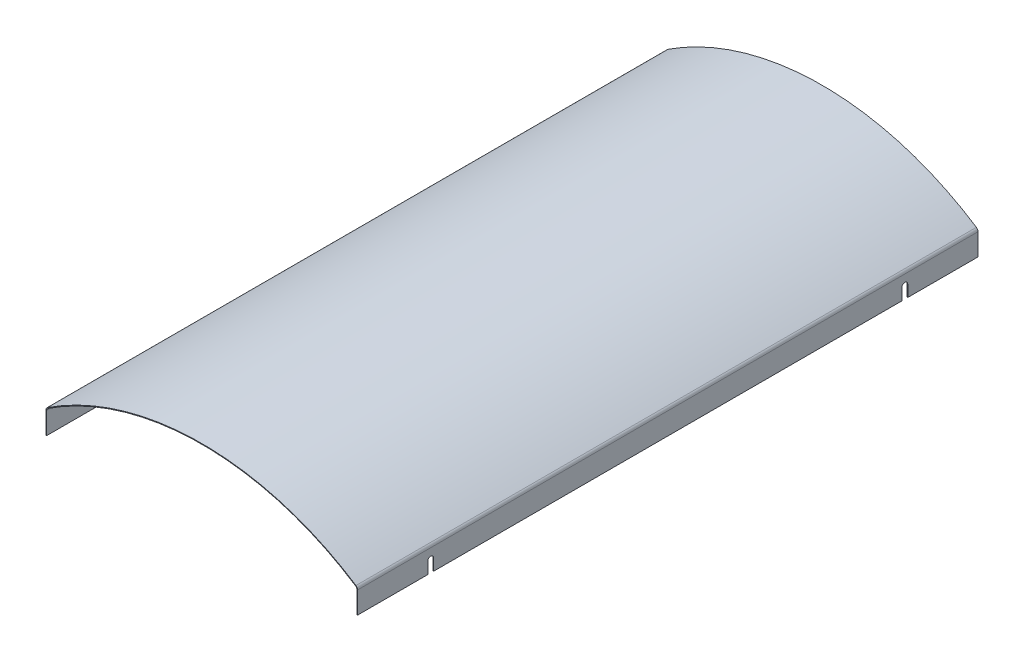
ISO-10303-21;
HEADER;
FILE_DESCRIPTION(('STEP AP214'),'2;1');
FILE_NAME('part.step','',(''),(''),'','','');
FILE_SCHEMA(('AUTOMOTIVE_DESIGN { 1 0 10303 214 1 1 1 1 }'));
ENDSEC;
DATA;
#1=APPLICATION_CONTEXT('core data for automotive mechanical design processes');
#2=APPLICATION_PROTOCOL_DEFINITION('international standard','automotive_design',2000,#1);
#3=PRODUCT_CONTEXT('',#1,'mechanical');
#4=PRODUCT('Part','Part','',(#3));
#5=PRODUCT_RELATED_PRODUCT_CATEGORY('part','',(#4));
#6=PRODUCT_DEFINITION_FORMATION('','',#4);
#7=PRODUCT_DEFINITION_CONTEXT('part definition',#1,'design');
#8=PRODUCT_DEFINITION('design','',#6,#7);
#9=PRODUCT_DEFINITION_SHAPE('','',#8);
#10=(LENGTH_UNIT() NAMED_UNIT(*) SI_UNIT(.MILLI.,.METRE.));
#11=(NAMED_UNIT(*) PLANE_ANGLE_UNIT() SI_UNIT($,.RADIAN.));
#12=(NAMED_UNIT(*) SI_UNIT($,.STERADIAN.) SOLID_ANGLE_UNIT());
#13=UNCERTAINTY_MEASURE_WITH_UNIT(LENGTH_MEASURE(1.E-05),#10,'distance_accuracy_value','');
#14=(GEOMETRIC_REPRESENTATION_CONTEXT(3) GLOBAL_UNCERTAINTY_ASSIGNED_CONTEXT((#13)) GLOBAL_UNIT_ASSIGNED_CONTEXT((#10,
#11,#12)) REPRESENTATION_CONTEXT('',''));
#15=CARTESIAN_POINT('',(0.,0.,0.));
#16=DIRECTION('',(0.,0.,1.));
#17=DIRECTION('',(1.,0.,0.));
#18=AXIS2_PLACEMENT_3D('',#15,#16,#17);
#19=CARTESIAN_POINT('',(-336.55,1067.07773657716,673.1));
#20=DIRECTION('',(0.,-1.,0.));
#21=DIRECTION('',(0.,0.,-1.));
#22=AXIS2_PLACEMENT_3D('',#19,#20,#21);
#23=PLANE('',#22);
#24=DIRECTION('',(-1.,0.,0.));
#25=VECTOR('',#24,1.);
#26=CARTESIAN_POINT('',(338.05,1067.07773657716,520.7));
#27=LINE('',#26,#25);
#28=CARTESIAN_POINT('',(-336.55,1067.07773657716,520.7));
#29=VERTEX_POINT('',#28);
#30=CARTESIAN_POINT('',(-338.050000000001,1067.07773657716,520.7));
#31=VERTEX_POINT('',#30);
#32=EDGE_CURVE('E253',#29,#31,#27,.T.);
#33=ORIENTED_EDGE('',*,*,#32,.F.);
#34=DIRECTION('',(0.,0.,-1.));
#35=VECTOR('',#34,1.);
#36=CARTESIAN_POINT('',(-336.55,1067.07773657716,673.1));
#37=LINE('',#36,#35);
#38=CARTESIAN_POINT('',(-336.55,1067.07773657716,673.1));
#39=VERTEX_POINT('',#38);
#40=EDGE_CURVE('E403',#39,#29,#37,.T.);
#41=ORIENTED_EDGE('',*,*,#40,.F.);
#42=DIRECTION('',(-1.,0.,0.));
#43=VECTOR('',#42,1.);
#44=CARTESIAN_POINT('',(-336.55,1067.07773657716,673.1));
#45=LINE('',#44,#43);
#46=CARTESIAN_POINT('',(-338.05,1067.07773657716,673.1));
#47=VERTEX_POINT('',#46);
#48=EDGE_CURVE('E374',#39,#47,#45,.T.);
#49=ORIENTED_EDGE('',*,*,#48,.T.);
#50=DIRECTION('',(0.,0.,-1.));
#51=VECTOR('',#50,1.);
#52=CARTESIAN_POINT('',(-338.05,1067.07773657716,673.1));
#53=LINE('',#52,#51);
#54=EDGE_CURVE('E408',#47,#31,#53,.T.);
#55=ORIENTED_EDGE('',*,*,#54,.T.);
#56=EDGE_LOOP('',(#33,#41,#49,#55));
#57=FACE_BOUND('',#56,.T.);
#58=ADVANCED_FACE('F32',(#57),#23,.T.);
#59=CARTESIAN_POINT('',(336.55,1067.07773657716,673.1));
#60=DIRECTION('',(0.,1.,0.));
#61=DIRECTION('',(0.,0.,1.));
#62=AXIS2_PLACEMENT_3D('',#59,#60,#61);
#63=PLANE('',#62);
#64=DIRECTION('',(0.,0.,-1.));
#65=VECTOR('',#64,1.);
#66=CARTESIAN_POINT('',(336.55,1067.07773657716,673.1));
#67=LINE('',#66,#65);
#68=CARTESIAN_POINT('',(336.55,1067.07773657716,673.1));
#69=VERTEX_POINT('',#68);
#70=CARTESIAN_POINT('',(336.55,1067.07773657716,520.7));
#71=VERTEX_POINT('',#70);
#72=EDGE_CURVE('E353',#69,#71,#67,.T.);
#73=ORIENTED_EDGE('',*,*,#72,.T.);
#74=CARTESIAN_POINT('',(338.05,1067.07773657716,520.7));
#75=VERTEX_POINT('',#74);
#76=EDGE_CURVE('E251',#75,#71,#27,.T.);
#77=ORIENTED_EDGE('',*,*,#76,.F.);
#78=DIRECTION('',(0.,0.,-1.));
#79=VECTOR('',#78,1.);
#80=CARTESIAN_POINT('',(338.05,1067.07773657716,673.1));
#81=LINE('',#80,#79);
#82=CARTESIAN_POINT('',(338.05,1067.07773657716,673.1));
#83=VERTEX_POINT('',#82);
#84=EDGE_CURVE('E349',#83,#75,#81,.T.);
#85=ORIENTED_EDGE('',*,*,#84,.F.);
#86=DIRECTION('',(1.,0.,0.));
#87=VECTOR('',#86,1.);
#88=CARTESIAN_POINT('',(336.55,1067.07773657716,673.1));
#89=LINE('',#88,#87);
#90=EDGE_CURVE('E323',#69,#83,#89,.T.);
#91=ORIENTED_EDGE('',*,*,#90,.F.);
#92=EDGE_LOOP('',(#73,#77,#85,#91));
#93=FACE_BOUND('',#92,.T.);
#94=ADVANCED_FACE('F471',(#93),#63,.F.);
#95=DIRECTION('',(-1.,0.,0.));
#96=VECTOR('',#95,1.);
#97=CARTESIAN_POINT('',(338.05,1067.07773657716,508.));
#98=LINE('',#97,#96);
#99=CARTESIAN_POINT('',(-336.55,1067.07773657716,508.));
#100=VERTEX_POINT('',#99);
#101=CARTESIAN_POINT('',(-338.050000000001,1067.07773657716,508.));
#102=VERTEX_POINT('',#101);
#103=EDGE_CURVE('E47',#100,#102,#98,.T.);
#104=ORIENTED_EDGE('',*,*,#103,.T.);
#105=CARTESIAN_POINT('',(-338.050000000001,1067.07773657716,-508.));
#106=VERTEX_POINT('',#105);
#107=EDGE_CURVE('E410',#102,#106,#53,.T.);
#108=ORIENTED_EDGE('',*,*,#107,.T.);
#109=DIRECTION('',(-1.,0.,0.));
#110=VECTOR('',#109,1.);
#111=CARTESIAN_POINT('',(338.05,1067.07773657716,-508.));
#112=LINE('',#111,#110);
#113=CARTESIAN_POINT('',(-336.55,1067.07773657716,-508.));
#114=VERTEX_POINT('',#113);
#115=EDGE_CURVE('E293',#114,#106,#112,.T.);
#116=ORIENTED_EDGE('',*,*,#115,.F.);
#117=EDGE_CURVE('E407',#100,#114,#37,.T.);
#118=ORIENTED_EDGE('',*,*,#117,.F.);
#119=EDGE_LOOP('',(#104,#108,#116,#118));
#120=FACE_BOUND('',#119,.T.);
#121=ADVANCED_FACE('F437',(#120),#23,.T.);
#122=CARTESIAN_POINT('',(338.05,1067.07773657716,508.));
#123=VERTEX_POINT('',#122);
#124=CARTESIAN_POINT('',(338.05,1067.07773657716,-508.));
#125=VERTEX_POINT('',#124);
#126=EDGE_CURVE('E352',#123,#125,#81,.T.);
#127=ORIENTED_EDGE('',*,*,#126,.F.);
#128=CARTESIAN_POINT('',(336.55,1067.07773657716,508.));
#129=VERTEX_POINT('',#128);
#130=EDGE_CURVE('E55',#123,#129,#98,.T.);
#131=ORIENTED_EDGE('',*,*,#130,.T.);
#132=CARTESIAN_POINT('',(336.55,1067.07773657716,-508.));
#133=VERTEX_POINT('',#132);
#134=EDGE_CURVE('E357',#129,#133,#67,.T.);
#135=ORIENTED_EDGE('',*,*,#134,.T.);
#136=EDGE_CURVE('E290',#125,#133,#112,.T.);
#137=ORIENTED_EDGE('',*,*,#136,.F.);
#138=EDGE_LOOP('',(#127,#131,#135,#137));
#139=FACE_BOUND('',#138,.T.);
#140=ADVANCED_FACE('F479',(#139),#63,.F.);
#141=CARTESIAN_POINT('',(-6.24500451351651E-13,609.600000000001,673.1));
#142=DIRECTION('',(0.,0.,-1.));
#143=DIRECTION('',(-1.,0.,0.));
#144=AXIS2_PLACEMENT_3D('',#141,#142,#143);
#145=CYLINDRICAL_SURFACE('',#144,609.599999999998);
#146=CARTESIAN_POINT('',(-6.24500451351651E-13,609.600000000001,-673.1));
#147=DIRECTION('',(0.,0.,-1.));
#148=DIRECTION('',(-1.,0.,0.));
#149=AXIS2_PLACEMENT_3D('',#146,#147,#148);
#150=CIRCLE('',#149,609.599999999998);
#151=CARTESIAN_POINT('',(-333.675789473684,1119.76921459366,-673.1));
#152=VERTEX_POINT('',#151);
#153=CARTESIAN_POINT('',(333.675789473684,1119.76921459366,-673.1));
#154=VERTEX_POINT('',#153);
#155=EDGE_CURVE('E362',#152,#154,#150,.T.);
#156=ORIENTED_EDGE('',*,*,#155,.T.);
#157=DIRECTION('',(0.,0.,-1.));
#158=VECTOR('',#157,1.);
#159=CARTESIAN_POINT('',(333.675789473684,1119.76921459366,673.1));
#160=LINE('',#159,#158);
#161=CARTESIAN_POINT('',(333.675789473684,1119.76921459366,673.1));
#162=VERTEX_POINT('',#161);
#163=EDGE_CURVE('E359',#162,#154,#160,.T.);
#164=ORIENTED_EDGE('',*,*,#163,.F.);
#165=CARTESIAN_POINT('',(-6.24500451351651E-13,609.600000000001,673.1));
#166=DIRECTION('',(0.,0.,-1.));
#167=DIRECTION('',(-1.,0.,0.));
#168=AXIS2_PLACEMENT_3D('',#165,#166,#167);
#169=CIRCLE('',#168,609.599999999998);
#170=CARTESIAN_POINT('',(-333.675789473684,1119.76921459366,673.1));
#171=VERTEX_POINT('',#170);
#172=EDGE_CURVE('E363',#171,#162,#169,.T.);
#173=ORIENTED_EDGE('',*,*,#172,.F.);
#174=DIRECTION('',(0.,0.,-1.));
#175=VECTOR('',#174,1.);
#176=CARTESIAN_POINT('',(-333.675789473684,1119.76921459366,673.1));
#177=LINE('',#176,#175);
#178=EDGE_CURVE('E381',#171,#152,#177,.T.);
#179=ORIENTED_EDGE('',*,*,#178,.T.);
#180=EDGE_LOOP('',(#156,#164,#173,#179));
#181=FACE_BOUND('',#180,.T.);
#182=ADVANCED_FACE('F34',(#181),#145,.F.);
#183=CARTESIAN_POINT('',(-6.24500451351651E-13,609.600000000001,673.1));
#184=DIRECTION('',(0.,0.,-1.));
#185=DIRECTION('',(-1.,0.,0.));
#186=AXIS2_PLACEMENT_3D('',#183,#184,#185);
#187=CYLINDRICAL_SURFACE('',#186,611.099999999998);
#188=CARTESIAN_POINT('',(-6.24500451351651E-13,609.600000000001,-673.1));
#189=DIRECTION('',(0.,0.,1.));
#190=DIRECTION('',(1.,0.,0.));
#191=AXIS2_PLACEMENT_3D('',#188,#189,#190);
#192=CIRCLE('',#191,611.099999999998);
#193=CARTESIAN_POINT('',(-334.496842105263,1121.024552228,-673.1));
#194=VERTEX_POINT('',#193);
#195=CARTESIAN_POINT('',(334.496842105263,1121.024552228,-673.1));
#196=VERTEX_POINT('',#195);
#197=EDGE_CURVE('E383',#194,#196,#192,.F.);
#198=ORIENTED_EDGE('',*,*,#197,.F.);
#199=DIRECTION('',(0.,0.,-1.));
#200=VECTOR('',#199,1.);
#201=CARTESIAN_POINT('',(-334.496842105263,1121.024552228,673.1));
#202=LINE('',#201,#200);
#203=CARTESIAN_POINT('',(-334.496842105263,1121.024552228,673.1));
#204=VERTEX_POINT('',#203);
#205=EDGE_CURVE('E11',#204,#194,#202,.T.);
#206=ORIENTED_EDGE('',*,*,#205,.F.);
#207=CARTESIAN_POINT('',(-6.24500451351651E-13,609.600000000001,673.1));
#208=DIRECTION('',(0.,0.,1.));
#209=DIRECTION('',(1.,0.,0.));
#210=AXIS2_PLACEMENT_3D('',#207,#208,#209);
#211=CIRCLE('',#210,611.099999999998);
#212=CARTESIAN_POINT('',(334.496842105263,1121.024552228,673.1));
#213=VERTEX_POINT('',#212);
#214=EDGE_CURVE('E365',#204,#213,#211,.F.);
#215=ORIENTED_EDGE('',*,*,#214,.T.);
#216=DIRECTION('',(0.,0.,-1.));
#217=VECTOR('',#216,1.);
#218=CARTESIAN_POINT('',(334.496842105263,1121.024552228,673.1));
#219=LINE('',#218,#217);
#220=EDGE_CURVE('E330',#213,#196,#219,.T.);
#221=ORIENTED_EDGE('',*,*,#220,.T.);
#222=EDGE_LOOP('',(#198,#206,#215,#221));
#223=FACE_BOUND('',#222,.T.);
#224=ADVANCED_FACE('F494',(#223),#187,.T.);
#225=CARTESIAN_POINT('',(-330.2,1114.45495194164,673.1));
#226=DIRECTION('',(0.,0.,-1.));
#227=DIRECTION('',(-1.,0.,0.));
#228=AXIS2_PLACEMENT_3D('',#225,#226,#227);
#229=CYLINDRICAL_SURFACE('',#228,7.84999999999997);
#230=CARTESIAN_POINT('',(-330.2,1114.45495194164,-673.1));
#231=DIRECTION('',(0.,0.,1.));
#232=DIRECTION('',(1.,0.,0.));
#233=AXIS2_PLACEMENT_3D('',#230,#231,#232);
#234=CIRCLE('',#233,7.84999999999997);
#235=CARTESIAN_POINT('',(-338.05,1114.45495194164,-673.1));
#236=VERTEX_POINT('',#235);
#237=EDGE_CURVE('E385',#236,#194,#234,.F.);
#238=ORIENTED_EDGE('',*,*,#237,.F.);
#239=DIRECTION('',(0.,0.,-1.));
#240=VECTOR('',#239,1.);
#241=CARTESIAN_POINT('',(-338.05,1114.45495194164,673.1));
#242=LINE('',#241,#240);
#243=CARTESIAN_POINT('',(-338.05,1114.45495194164,673.1));
#244=VERTEX_POINT('',#243);
#245=EDGE_CURVE('E40',#244,#236,#242,.T.);
#246=ORIENTED_EDGE('',*,*,#245,.F.);
#247=CARTESIAN_POINT('',(-330.2,1114.45495194164,673.1));
#248=DIRECTION('',(0.,0.,1.));
#249=DIRECTION('',(1.,0.,0.));
#250=AXIS2_PLACEMENT_3D('',#247,#248,#249);
#251=CIRCLE('',#250,7.84999999999997);
#252=EDGE_CURVE('E368',#244,#204,#251,.F.);
#253=ORIENTED_EDGE('',*,*,#252,.T.);
#254=ORIENTED_EDGE('',*,*,#205,.T.);
#255=EDGE_LOOP('',(#238,#246,#253,#254));
#256=FACE_BOUND('',#255,.T.);
#257=ADVANCED_FACE('F420',(#256),#229,.T.);
#258=CARTESIAN_POINT('',(-338.05,1067.07773657716,673.1));
#259=DIRECTION('',(-1.,0.,0.));
#260=DIRECTION('',(0.,-1.,0.));
#261=AXIS2_PLACEMENT_3D('',#258,#259,#260);
#262=PLANE('',#261);
#263=DIRECTION('',(0.,1.,0.));
#264=VECTOR('',#263,1.);
#265=CARTESIAN_POINT('',(-338.050000000001,1092.2,520.7));
#266=LINE('',#265,#264);
#267=CARTESIAN_POINT('',(-338.050000000001,1092.2,520.7));
#268=VERTEX_POINT('',#267);
#269=EDGE_CURVE('E236',#31,#268,#266,.T.);
#270=ORIENTED_EDGE('',*,*,#269,.F.);
#271=ORIENTED_EDGE('',*,*,#54,.F.);
#272=DIRECTION('',(0.,1.,0.));
#273=VECTOR('',#272,1.);
#274=CARTESIAN_POINT('',(-338.05,1067.07773657716,673.1));
#275=LINE('',#274,#273);
#276=EDGE_CURVE('E371',#47,#244,#275,.T.);
#277=ORIENTED_EDGE('',*,*,#276,.T.);
#278=ORIENTED_EDGE('',*,*,#245,.T.);
#279=DIRECTION('',(0.,1.,0.));
#280=VECTOR('',#279,1.);
#281=CARTESIAN_POINT('',(-338.05,1067.07773657716,-673.1));
#282=LINE('',#281,#280);
#283=CARTESIAN_POINT('',(-338.05,1067.07773657716,-673.1));
#284=VERTEX_POINT('',#283);
#285=EDGE_CURVE('E388',#284,#236,#282,.T.);
#286=ORIENTED_EDGE('',*,*,#285,.F.);
#287=CARTESIAN_POINT('',(-338.050000000001,1067.07773657716,-520.7));
#288=VERTEX_POINT('',#287);
#289=EDGE_CURVE('E406',#288,#284,#53,.T.);
#290=ORIENTED_EDGE('',*,*,#289,.F.);
#291=DIRECTION('',(0.,-1.,0.));
#292=VECTOR('',#291,1.);
#293=CARTESIAN_POINT('',(-338.050000000001,1092.2,-520.7));
#294=LINE('',#293,#292);
#295=CARTESIAN_POINT('',(-338.050000000001,1092.2,-520.7));
#296=VERTEX_POINT('',#295);
#297=EDGE_CURVE('E281',#296,#288,#294,.T.);
#298=ORIENTED_EDGE('',*,*,#297,.F.);
#299=CARTESIAN_POINT('',(-338.050000000001,1092.2,-514.35));
#300=DIRECTION('',(-1.,0.,0.));
#301=DIRECTION('',(0.,0.,-1.));
#302=AXIS2_PLACEMENT_3D('',#299,#300,#301);
#303=CIRCLE('',#302,6.35000000000019);
#304=CARTESIAN_POINT('',(-338.050000000001,1092.2,-508.));
#305=VERTEX_POINT('',#304);
#306=EDGE_CURVE('E267',#305,#296,#303,.T.);
#307=ORIENTED_EDGE('',*,*,#306,.F.);
#308=DIRECTION('',(0.,1.,0.));
#309=VECTOR('',#308,1.);
#310=CARTESIAN_POINT('',(-338.050000000001,1092.2,-508.));
#311=LINE('',#310,#309);
#312=EDGE_CURVE('E272',#106,#305,#311,.T.);
#313=ORIENTED_EDGE('',*,*,#312,.F.);
#314=ORIENTED_EDGE('',*,*,#107,.F.);
#315=DIRECTION('',(0.,-1.,0.));
#316=VECTOR('',#315,1.);
#317=CARTESIAN_POINT('',(-338.050000000001,1092.2,508.));
#318=LINE('',#317,#316);
#319=CARTESIAN_POINT('',(-338.050000000001,1092.2,508.));
#320=VERTEX_POINT('',#319);
#321=EDGE_CURVE('E239',#320,#102,#318,.T.);
#322=ORIENTED_EDGE('',*,*,#321,.F.);
#323=CARTESIAN_POINT('',(-338.050000000001,1092.2,514.35));
#324=DIRECTION('',(-1.,0.,0.));
#325=DIRECTION('',(0.,0.,1.));
#326=AXIS2_PLACEMENT_3D('',#323,#324,#325);
#327=CIRCLE('',#326,6.35000000000019);
#328=EDGE_CURVE('E243',#268,#320,#327,.T.);
#329=ORIENTED_EDGE('',*,*,#328,.F.);
#330=EDGE_LOOP('',(#270,#271,#277,#278,#286,#290,#298,#307,#313,#314,#322,#329));
#331=FACE_BOUND('',#330,.T.);
#332=ADVANCED_FACE('F415',(#331),#262,.T.);
#333=DIRECTION('',(-1.,0.,0.));
#334=VECTOR('',#333,1.);
#335=CARTESIAN_POINT('',(338.05,1067.07773657716,-520.7));
#336=LINE('',#335,#334);
#337=CARTESIAN_POINT('',(-336.55,1067.07773657716,-520.7));
#338=VERTEX_POINT('',#337);
#339=EDGE_CURVE('E297',#338,#288,#336,.T.);
#340=ORIENTED_EDGE('',*,*,#339,.T.);
#341=ORIENTED_EDGE('',*,*,#289,.T.);
#342=DIRECTION('',(-1.,0.,0.));
#343=VECTOR('',#342,1.);
#344=CARTESIAN_POINT('',(-336.55,1067.07773657716,-673.1));
#345=LINE('',#344,#343);
#346=CARTESIAN_POINT('',(-336.55,1067.07773657716,-673.1));
#347=VERTEX_POINT('',#346);
#348=EDGE_CURVE('E391',#347,#284,#345,.T.);
#349=ORIENTED_EDGE('',*,*,#348,.F.);
#350=EDGE_CURVE('E402',#338,#347,#37,.T.);
#351=ORIENTED_EDGE('',*,*,#350,.F.);
#352=EDGE_LOOP('',(#340,#341,#349,#351));
#353=FACE_BOUND('',#352,.T.);
#354=ADVANCED_FACE('F431',(#353),#23,.T.);
#355=CARTESIAN_POINT('',(-336.55,1067.07773657716,673.1));
#356=DIRECTION('',(-1.,0.,0.));
#357=DIRECTION('',(0.,-1.,0.));
#358=AXIS2_PLACEMENT_3D('',#355,#356,#357);
#359=PLANE('',#358);
#360=ORIENTED_EDGE('',*,*,#40,.T.);
#361=DIRECTION('',(0.,1.,0.));
#362=VECTOR('',#361,1.);
#363=CARTESIAN_POINT('',(-336.55,1067.07773657716,520.7));
#364=LINE('',#363,#362);
#365=CARTESIAN_POINT('',(-336.55,1092.2,520.7));
#366=VERTEX_POINT('',#365);
#367=EDGE_CURVE('E260',#29,#366,#364,.T.);
#368=ORIENTED_EDGE('',*,*,#367,.T.);
#369=CARTESIAN_POINT('',(-336.55,1092.2,514.35));
#370=DIRECTION('',(-1.,0.,0.));
#371=DIRECTION('',(0.,-1.,0.));
#372=AXIS2_PLACEMENT_3D('',#369,#370,#371);
#373=CIRCLE('',#372,6.35000000000019);
#374=CARTESIAN_POINT('',(-336.55,1092.2,508.));
#375=VERTEX_POINT('',#374);
#376=EDGE_CURVE('E264',#366,#375,#373,.T.);
#377=ORIENTED_EDGE('',*,*,#376,.T.);
#378=DIRECTION('',(0.,-1.,0.));
#379=VECTOR('',#378,1.);
#380=CARTESIAN_POINT('',(-336.55,1067.07773657716,508.));
#381=LINE('',#380,#379);
#382=EDGE_CURVE('E256',#375,#100,#381,.T.);
#383=ORIENTED_EDGE('',*,*,#382,.T.);
#384=ORIENTED_EDGE('',*,*,#117,.T.);
#385=DIRECTION('',(0.,1.,0.));
#386=VECTOR('',#385,1.);
#387=CARTESIAN_POINT('',(-336.55,1067.07773657716,-508.));
#388=LINE('',#387,#386);
#389=CARTESIAN_POINT('',(-336.55,1092.2,-508.));
#390=VERTEX_POINT('',#389);
#391=EDGE_CURVE('E307',#114,#390,#388,.T.);
#392=ORIENTED_EDGE('',*,*,#391,.T.);
#393=CARTESIAN_POINT('',(-336.55,1092.2,-514.35));
#394=DIRECTION('',(-1.,0.,0.));
#395=DIRECTION('',(0.,-1.,0.));
#396=AXIS2_PLACEMENT_3D('',#393,#394,#395);
#397=CIRCLE('',#396,6.35000000000019);
#398=CARTESIAN_POINT('',(-336.55,1092.2,-520.7));
#399=VERTEX_POINT('',#398);
#400=EDGE_CURVE('E312',#390,#399,#397,.T.);
#401=ORIENTED_EDGE('',*,*,#400,.T.);
#402=DIRECTION('',(0.,-1.,0.));
#403=VECTOR('',#402,1.);
#404=CARTESIAN_POINT('',(-336.55,1067.07773657716,-520.700000000001));
#405=LINE('',#404,#403);
#406=EDGE_CURVE('E302',#399,#338,#405,.T.);
#407=ORIENTED_EDGE('',*,*,#406,.T.);
#408=ORIENTED_EDGE('',*,*,#350,.T.);
#409=DIRECTION('',(0.,1.,0.));
#410=VECTOR('',#409,1.);
#411=CARTESIAN_POINT('',(-336.55,1067.07773657716,-673.1));
#412=LINE('',#411,#410);
#413=CARTESIAN_POINT('',(-336.55,1114.45495194164,-673.1));
#414=VERTEX_POINT('',#413);
#415=EDGE_CURVE('E394',#347,#414,#412,.T.);
#416=ORIENTED_EDGE('',*,*,#415,.T.);
#417=DIRECTION('',(0.,0.,-1.));
#418=VECTOR('',#417,1.);
#419=CARTESIAN_POINT('',(-336.55,1114.45495194164,673.1));
#420=LINE('',#419,#418);
#421=CARTESIAN_POINT('',(-336.55,1114.45495194164,673.1));
#422=VERTEX_POINT('',#421);
#423=EDGE_CURVE('E399',#422,#414,#420,.T.);
#424=ORIENTED_EDGE('',*,*,#423,.F.);
#425=DIRECTION('',(0.,1.,0.));
#426=VECTOR('',#425,1.);
#427=CARTESIAN_POINT('',(-336.55,1067.07773657716,673.1));
#428=LINE('',#427,#426);
#429=EDGE_CURVE('E377',#39,#422,#428,.T.);
#430=ORIENTED_EDGE('',*,*,#429,.F.);
#431=EDGE_LOOP('',(#360,#368,#377,#383,#384,#392,#401,#407,#408,#416,#424,#430));
#432=FACE_BOUND('',#431,.T.);
#433=ADVANCED_FACE('F450',(#432),#359,.F.);
#434=CARTESIAN_POINT('',(-330.2,1114.45495194164,673.1));
#435=DIRECTION('',(0.,0.,-1.));
#436=DIRECTION('',(-1.,0.,0.));
#437=AXIS2_PLACEMENT_3D('',#434,#435,#436);
#438=CYLINDRICAL_SURFACE('',#437,6.34999999999997);
#439=CARTESIAN_POINT('',(-330.2,1114.45495194164,-673.1));
#440=DIRECTION('',(0.,0.,-1.));
#441=DIRECTION('',(-1.,0.,0.));
#442=AXIS2_PLACEMENT_3D('',#439,#440,#441);
#443=CIRCLE('',#442,6.34999999999997);
#444=EDGE_CURVE('E366',#414,#152,#443,.T.);
#445=ORIENTED_EDGE('',*,*,#444,.T.);
#446=ORIENTED_EDGE('',*,*,#178,.F.);
#447=CARTESIAN_POINT('',(-330.2,1114.45495194164,673.1));
#448=DIRECTION('',(0.,0.,-1.));
#449=DIRECTION('',(-1.,0.,0.));
#450=AXIS2_PLACEMENT_3D('',#447,#448,#449);
#451=CIRCLE('',#450,6.34999999999997);
#452=EDGE_CURVE('E379',#422,#171,#451,.T.);
#453=ORIENTED_EDGE('',*,*,#452,.F.);
#454=ORIENTED_EDGE('',*,*,#423,.T.);
#455=EDGE_LOOP('',(#445,#446,#453,#454));
#456=FACE_BOUND('',#455,.T.);
#457=ADVANCED_FACE('F490',(#456),#438,.F.);
#458=CARTESIAN_POINT('',(-6.24500451351651E-13,609.600000000001,673.1));
#459=DIRECTION('',(0.,0.,-1.));
#460=DIRECTION('',(-1.,0.,0.));
#461=AXIS2_PLACEMENT_3D('',#458,#459,#460);
#462=PLANE('',#461);
#463=ORIENTED_EDGE('',*,*,#172,.T.);
#464=CARTESIAN_POINT('',(330.2,1114.45495194164,673.1));
#465=DIRECTION('',(0.,0.,1.));
#466=DIRECTION('',(1.,0.,0.));
#467=AXIS2_PLACEMENT_3D('',#464,#465,#466);
#468=CIRCLE('',#467,6.34999999999997);
#469=CARTESIAN_POINT('',(336.55,1114.45495194164,673.1));
#470=VERTEX_POINT('',#469);
#471=EDGE_CURVE('E316',#470,#162,#468,.T.);
#472=ORIENTED_EDGE('',*,*,#471,.F.);
#473=DIRECTION('',(0.,1.,0.));
#474=VECTOR('',#473,1.);
#475=CARTESIAN_POINT('',(336.55,1067.07773657716,673.1));
#476=LINE('',#475,#474);
#477=EDGE_CURVE('E319',#69,#470,#476,.T.);
#478=ORIENTED_EDGE('',*,*,#477,.F.);
#479=ORIENTED_EDGE('',*,*,#90,.T.);
#480=DIRECTION('',(0.,1.,0.));
#481=VECTOR('',#480,1.);
#482=CARTESIAN_POINT('',(338.05,1067.07773657716,673.1));
#483=LINE('',#482,#481);
#484=CARTESIAN_POINT('',(338.05,1114.45495194164,673.1));
#485=VERTEX_POINT('',#484);
#486=EDGE_CURVE('E325',#83,#485,#483,.T.);
#487=ORIENTED_EDGE('',*,*,#486,.T.);
#488=CARTESIAN_POINT('',(330.2,1114.45495194164,673.1));
#489=DIRECTION('',(0.,0.,-1.));
#490=DIRECTION('',(-1.,0.,0.));
#491=AXIS2_PLACEMENT_3D('',#488,#489,#490);
#492=CIRCLE('',#491,7.84999999999997);
#493=EDGE_CURVE('E327',#485,#213,#492,.F.);
#494=ORIENTED_EDGE('',*,*,#493,.T.);
#495=ORIENTED_EDGE('',*,*,#214,.F.);
#496=ORIENTED_EDGE('',*,*,#252,.F.);
#497=ORIENTED_EDGE('',*,*,#276,.F.);
#498=ORIENTED_EDGE('',*,*,#48,.F.);
#499=ORIENTED_EDGE('',*,*,#429,.T.);
#500=ORIENTED_EDGE('',*,*,#452,.T.);
#501=EDGE_LOOP('',(#463,#472,#478,#479,#487,#494,#495,#496,#497,#498,#499,#500));
#502=FACE_BOUND('',#501,.T.);
#503=ADVANCED_FACE('F532',(#502),#462,.F.);
#504=CARTESIAN_POINT('',(-6.24500451351651E-13,609.600000000001,-673.1));
#505=DIRECTION('',(0.,0.,-1.));
#506=DIRECTION('',(-1.,0.,0.));
#507=AXIS2_PLACEMENT_3D('',#504,#505,#506);
#508=PLANE('',#507);
#509=ORIENTED_EDGE('',*,*,#155,.F.);
#510=ORIENTED_EDGE('',*,*,#444,.F.);
#511=ORIENTED_EDGE('',*,*,#415,.F.);
#512=ORIENTED_EDGE('',*,*,#348,.T.);
#513=ORIENTED_EDGE('',*,*,#285,.T.);
#514=ORIENTED_EDGE('',*,*,#237,.T.);
#515=ORIENTED_EDGE('',*,*,#197,.T.);
#516=CARTESIAN_POINT('',(330.2,1114.45495194164,-673.1));
#517=DIRECTION('',(0.,0.,-1.));
#518=DIRECTION('',(-1.,0.,0.));
#519=AXIS2_PLACEMENT_3D('',#516,#517,#518);
#520=CIRCLE('',#519,7.84999999999997);
#521=CARTESIAN_POINT('',(338.05,1114.45495194164,-673.1));
#522=VERTEX_POINT('',#521);
#523=EDGE_CURVE('E320',#522,#196,#520,.F.);
#524=ORIENTED_EDGE('',*,*,#523,.F.);
#525=DIRECTION('',(0.,1.,0.));
#526=VECTOR('',#525,1.);
#527=CARTESIAN_POINT('',(338.05,1067.07773657716,-673.1));
#528=LINE('',#527,#526);
#529=CARTESIAN_POINT('',(338.05,1067.07773657716,-673.1));
#530=VERTEX_POINT('',#529);
#531=EDGE_CURVE('E339',#530,#522,#528,.T.);
#532=ORIENTED_EDGE('',*,*,#531,.F.);
#533=DIRECTION('',(1.,0.,0.));
#534=VECTOR('',#533,1.);
#535=CARTESIAN_POINT('',(336.55,1067.07773657716,-673.1));
#536=LINE('',#535,#534);
#537=CARTESIAN_POINT('',(336.55,1067.07773657716,-673.1));
#538=VERTEX_POINT('',#537);
#539=EDGE_CURVE('E336',#538,#530,#536,.T.);
#540=ORIENTED_EDGE('',*,*,#539,.F.);
#541=DIRECTION('',(0.,1.,0.));
#542=VECTOR('',#541,1.);
#543=CARTESIAN_POINT('',(336.55,1067.07773657716,-673.1));
#544=LINE('',#543,#542);
#545=CARTESIAN_POINT('',(336.55,1114.45495194164,-673.1));
#546=VERTEX_POINT('',#545);
#547=EDGE_CURVE('E333',#538,#546,#544,.T.);
#548=ORIENTED_EDGE('',*,*,#547,.T.);
#549=CARTESIAN_POINT('',(330.2,1114.45495194164,-673.1));
#550=DIRECTION('',(0.,0.,1.));
#551=DIRECTION('',(1.,0.,0.));
#552=AXIS2_PLACEMENT_3D('',#549,#550,#551);
#553=CIRCLE('',#552,6.34999999999997);
#554=EDGE_CURVE('E315',#546,#154,#553,.T.);
#555=ORIENTED_EDGE('',*,*,#554,.T.);
#556=EDGE_LOOP('',(#509,#510,#511,#512,#513,#514,#515,#524,#532,#540,#548,#555));
#557=FACE_BOUND('',#556,.T.);
#558=ADVANCED_FACE('F424',(#557),#508,.T.);
#559=CARTESIAN_POINT('',(330.2,1114.45495194164,673.1));
#560=DIRECTION('',(0.,0.,-1.));
#561=DIRECTION('',(-1.,0.,0.));
#562=AXIS2_PLACEMENT_3D('',#559,#560,#561);
#563=CYLINDRICAL_SURFACE('',#562,6.34999999999997);
#564=ORIENTED_EDGE('',*,*,#554,.F.);
#565=DIRECTION('',(0.,0.,-1.));
#566=VECTOR('',#565,1.);
#567=CARTESIAN_POINT('',(336.55,1114.45495194164,673.1));
#568=LINE('',#567,#566);
#569=EDGE_CURVE('E356',#470,#546,#568,.T.);
#570=ORIENTED_EDGE('',*,*,#569,.F.);
#571=ORIENTED_EDGE('',*,*,#471,.T.);
#572=ORIENTED_EDGE('',*,*,#163,.T.);
#573=EDGE_LOOP('',(#564,#570,#571,#572));
#574=FACE_BOUND('',#573,.T.);
#575=ADVANCED_FACE('F523',(#574),#563,.F.);
#576=CARTESIAN_POINT('',(336.55,1067.07773657716,673.1));
#577=DIRECTION('',(-1.,0.,0.));
#578=DIRECTION('',(0.,-1.,0.));
#579=AXIS2_PLACEMENT_3D('',#576,#577,#578);
#580=PLANE('',#579);
#581=DIRECTION('',(0.,1.,0.));
#582=VECTOR('',#581,1.);
#583=CARTESIAN_POINT('',(336.55,1067.07773657716,520.7));
#584=LINE('',#583,#582);
#585=CARTESIAN_POINT('',(336.55,1092.2,520.7));
#586=VERTEX_POINT('',#585);
#587=EDGE_CURVE('E258',#71,#586,#584,.T.);
#588=ORIENTED_EDGE('',*,*,#587,.F.);
#589=ORIENTED_EDGE('',*,*,#72,.F.);
#590=ORIENTED_EDGE('',*,*,#477,.T.);
#591=ORIENTED_EDGE('',*,*,#569,.T.);
#592=ORIENTED_EDGE('',*,*,#547,.F.);
#593=CARTESIAN_POINT('',(336.55,1067.07773657716,-520.7));
#594=VERTEX_POINT('',#593);
#595=EDGE_CURVE('E351',#594,#538,#67,.T.);
#596=ORIENTED_EDGE('',*,*,#595,.F.);
#597=DIRECTION('',(0.,-1.,0.));
#598=VECTOR('',#597,1.);
#599=CARTESIAN_POINT('',(336.55,1067.07773657716,-520.700000000001));
#600=LINE('',#599,#598);
#601=CARTESIAN_POINT('',(336.55,1092.2,-520.7));
#602=VERTEX_POINT('',#601);
#603=EDGE_CURVE('E288',#602,#594,#600,.T.);
#604=ORIENTED_EDGE('',*,*,#603,.F.);
#605=CARTESIAN_POINT('',(336.55,1092.2,-514.35));
#606=DIRECTION('',(-1.,0.,0.));
#607=DIRECTION('',(0.,-1.,0.));
#608=AXIS2_PLACEMENT_3D('',#605,#606,#607);
#609=CIRCLE('',#608,6.35000000000019);
#610=CARTESIAN_POINT('',(336.55,1092.2,-508.));
#611=VERTEX_POINT('',#610);
#612=EDGE_CURVE('E310',#611,#602,#609,.T.);
#613=ORIENTED_EDGE('',*,*,#612,.F.);
#614=DIRECTION('',(0.,1.,0.));
#615=VECTOR('',#614,1.);
#616=CARTESIAN_POINT('',(336.55,1067.07773657716,-508.));
#617=LINE('',#616,#615);
#618=EDGE_CURVE('E305',#133,#611,#617,.T.);
#619=ORIENTED_EDGE('',*,*,#618,.F.);
#620=ORIENTED_EDGE('',*,*,#134,.F.);
#621=DIRECTION('',(0.,-1.,0.));
#622=VECTOR('',#621,1.);
#623=CARTESIAN_POINT('',(336.55,1067.07773657716,508.));
#624=LINE('',#623,#622);
#625=CARTESIAN_POINT('',(336.55,1092.2,508.));
#626=VERTEX_POINT('',#625);
#627=EDGE_CURVE('E249',#626,#129,#624,.T.);
#628=ORIENTED_EDGE('',*,*,#627,.F.);
#629=CARTESIAN_POINT('',(336.55,1092.2,514.35));
#630=DIRECTION('',(-1.,0.,0.));
#631=DIRECTION('',(0.,-1.,0.));
#632=AXIS2_PLACEMENT_3D('',#629,#630,#631);
#633=CIRCLE('',#632,6.35000000000019);
#634=EDGE_CURVE('E224',#586,#626,#633,.T.);
#635=ORIENTED_EDGE('',*,*,#634,.F.);
#636=EDGE_LOOP('',(#588,#589,#590,#591,#592,#596,#604,#613,#619,#620,#628,#635));
#637=FACE_BOUND('',#636,.T.);
#638=ADVANCED_FACE('F517',(#637),#580,.T.);
#639=CARTESIAN_POINT('',(338.05,1067.07773657716,-520.7));
#640=VERTEX_POINT('',#639);
#641=EDGE_CURVE('E348',#640,#530,#81,.T.);
#642=ORIENTED_EDGE('',*,*,#641,.F.);
#643=EDGE_CURVE('E294',#640,#594,#336,.T.);
#644=ORIENTED_EDGE('',*,*,#643,.T.);
#645=ORIENTED_EDGE('',*,*,#595,.T.);
#646=ORIENTED_EDGE('',*,*,#539,.T.);
#647=EDGE_LOOP('',(#642,#644,#645,#646));
#648=FACE_BOUND('',#647,.T.);
#649=ADVANCED_FACE('F480',(#648),#63,.F.);
#650=CARTESIAN_POINT('',(338.05,1067.07773657716,673.1));
#651=DIRECTION('',(-1.,0.,0.));
#652=DIRECTION('',(0.,-1.,0.));
#653=AXIS2_PLACEMENT_3D('',#650,#651,#652);
#654=PLANE('',#653);
#655=ORIENTED_EDGE('',*,*,#84,.T.);
#656=DIRECTION('',(0.,1.,0.));
#657=VECTOR('',#656,1.);
#658=CARTESIAN_POINT('',(338.05,1092.2,520.7));
#659=LINE('',#658,#657);
#660=CARTESIAN_POINT('',(338.05,1092.2,520.7));
#661=VERTEX_POINT('',#660);
#662=EDGE_CURVE('E232',#75,#661,#659,.T.);
#663=ORIENTED_EDGE('',*,*,#662,.T.);
#664=CARTESIAN_POINT('',(338.05,1092.2,514.35));
#665=DIRECTION('',(-1.,0.,0.));
#666=DIRECTION('',(0.,0.,1.));
#667=AXIS2_PLACEMENT_3D('',#664,#665,#666);
#668=CIRCLE('',#667,6.35000000000019);
#669=CARTESIAN_POINT('',(338.05,1092.2,508.));
#670=VERTEX_POINT('',#669);
#671=EDGE_CURVE('E221',#661,#670,#668,.T.);
#672=ORIENTED_EDGE('',*,*,#671,.T.);
#673=DIRECTION('',(0.,-1.,0.));
#674=VECTOR('',#673,1.);
#675=CARTESIAN_POINT('',(338.05,1092.2,508.));
#676=LINE('',#675,#674);
#677=EDGE_CURVE('E228',#670,#123,#676,.T.);
#678=ORIENTED_EDGE('',*,*,#677,.T.);
#679=ORIENTED_EDGE('',*,*,#126,.T.);
#680=DIRECTION('',(0.,1.,0.));
#681=VECTOR('',#680,1.);
#682=CARTESIAN_POINT('',(338.05,1092.2,-508.));
#683=LINE('',#682,#681);
#684=CARTESIAN_POINT('',(338.05,1092.2,-508.));
#685=VERTEX_POINT('',#684);
#686=EDGE_CURVE('E275',#125,#685,#683,.T.);
#687=ORIENTED_EDGE('',*,*,#686,.T.);
#688=CARTESIAN_POINT('',(338.05,1092.2,-514.35));
#689=DIRECTION('',(-1.,0.,0.));
#690=DIRECTION('',(0.,0.,-1.));
#691=AXIS2_PLACEMENT_3D('',#688,#689,#690);
#692=CIRCLE('',#691,6.35000000000019);
#693=CARTESIAN_POINT('',(338.05,1092.2,-520.7));
#694=VERTEX_POINT('',#693);
#695=EDGE_CURVE('E268',#685,#694,#692,.T.);
#696=ORIENTED_EDGE('',*,*,#695,.T.);
#697=DIRECTION('',(0.,-1.,0.));
#698=VECTOR('',#697,1.);
#699=CARTESIAN_POINT('',(338.05,1092.2,-520.7));
#700=LINE('',#699,#698);
#701=EDGE_CURVE('E271',#694,#640,#700,.T.);
#702=ORIENTED_EDGE('',*,*,#701,.T.);
#703=ORIENTED_EDGE('',*,*,#641,.T.);
#704=ORIENTED_EDGE('',*,*,#531,.T.);
#705=DIRECTION('',(0.,0.,-1.));
#706=VECTOR('',#705,1.);
#707=CARTESIAN_POINT('',(338.05,1114.45495194164,673.1));
#708=LINE('',#707,#706);
#709=EDGE_CURVE('E345',#485,#522,#708,.T.);
#710=ORIENTED_EDGE('',*,*,#709,.F.);
#711=ORIENTED_EDGE('',*,*,#486,.F.);
#712=EDGE_LOOP('',(#655,#663,#672,#678,#679,#687,#696,#702,#703,#704,#710,#711));
#713=FACE_BOUND('',#712,.T.);
#714=ADVANCED_FACE('F235',(#713),#654,.F.);
#715=CARTESIAN_POINT('',(330.2,1114.45495194164,673.1));
#716=DIRECTION('',(0.,0.,-1.));
#717=DIRECTION('',(-1.,0.,0.));
#718=AXIS2_PLACEMENT_3D('',#715,#716,#717);
#719=CYLINDRICAL_SURFACE('',#718,7.84999999999997);
#720=ORIENTED_EDGE('',*,*,#523,.T.);
#721=ORIENTED_EDGE('',*,*,#220,.F.);
#722=ORIENTED_EDGE('',*,*,#493,.F.);
#723=ORIENTED_EDGE('',*,*,#709,.T.);
#724=EDGE_LOOP('',(#720,#721,#722,#723));
#725=FACE_BOUND('',#724,.T.);
#726=ADVANCED_FACE('F468',(#725),#719,.T.);
#727=CARTESIAN_POINT('',(338.05,1092.2,-520.7));
#728=DIRECTION('',(0.,0.,-1.));
#729=DIRECTION('',(0.,1.,0.));
#730=AXIS2_PLACEMENT_3D('',#727,#728,#729);
#731=PLANE('',#730);
#732=ORIENTED_EDGE('',*,*,#603,.T.);
#733=ORIENTED_EDGE('',*,*,#643,.F.);
#734=ORIENTED_EDGE('',*,*,#701,.F.);
#735=DIRECTION('',(-1.,0.,0.));
#736=VECTOR('',#735,1.);
#737=CARTESIAN_POINT('',(338.05,1092.2,-520.7));
#738=LINE('',#737,#736);
#739=EDGE_CURVE('E298',#694,#602,#738,.T.);
#740=ORIENTED_EDGE('',*,*,#739,.T.);
#741=EDGE_LOOP('',(#732,#733,#734,#740));
#742=FACE_BOUND('',#741,.T.);
#743=ADVANCED_FACE('F456',(#742),#731,.F.);
#744=CARTESIAN_POINT('',(338.05,1092.2,-508.));
#745=DIRECTION('',(0.,0.,1.));
#746=DIRECTION('',(0.,-1.,0.));
#747=AXIS2_PLACEMENT_3D('',#744,#745,#746);
#748=PLANE('',#747);
#749=ORIENTED_EDGE('',*,*,#618,.T.);
#750=DIRECTION('',(-1.,0.,0.));
#751=VECTOR('',#750,1.);
#752=CARTESIAN_POINT('',(338.05,1092.2,-508.));
#753=LINE('',#752,#751);
#754=EDGE_CURVE('E285',#685,#611,#753,.T.);
#755=ORIENTED_EDGE('',*,*,#754,.F.);
#756=ORIENTED_EDGE('',*,*,#686,.F.);
#757=ORIENTED_EDGE('',*,*,#136,.T.);
#758=EDGE_LOOP('',(#749,#755,#756,#757));
#759=FACE_BOUND('',#758,.T.);
#760=ADVANCED_FACE('F465',(#759),#748,.F.);
#761=CARTESIAN_POINT('',(338.05,1092.2,-514.35));
#762=DIRECTION('',(-1.,0.,0.));
#763=DIRECTION('',(0.,0.,1.));
#764=AXIS2_PLACEMENT_3D('',#761,#762,#763);
#765=CYLINDRICAL_SURFACE('',#764,6.35000000000019);
#766=ORIENTED_EDGE('',*,*,#612,.T.);
#767=ORIENTED_EDGE('',*,*,#739,.F.);
#768=ORIENTED_EDGE('',*,*,#695,.F.);
#769=ORIENTED_EDGE('',*,*,#754,.T.);
#770=EDGE_LOOP('',(#766,#767,#768,#769));
#771=FACE_BOUND('',#770,.T.);
#772=ADVANCED_FACE('F548',(#771),#765,.F.);
#773=EDGE_CURVE('E289',#390,#305,#753,.T.);
#774=ORIENTED_EDGE('',*,*,#773,.T.);
#775=ORIENTED_EDGE('',*,*,#306,.T.);
#776=EDGE_CURVE('E278',#399,#296,#738,.T.);
#777=ORIENTED_EDGE('',*,*,#776,.F.);
#778=ORIENTED_EDGE('',*,*,#400,.F.);
#779=EDGE_LOOP('',(#774,#775,#777,#778));
#780=FACE_BOUND('',#779,.T.);
#781=ADVANCED_FACE('F448',(#780),#765,.F.);
#782=ORIENTED_EDGE('',*,*,#115,.T.);
#783=ORIENTED_EDGE('',*,*,#312,.T.);
#784=ORIENTED_EDGE('',*,*,#773,.F.);
#785=ORIENTED_EDGE('',*,*,#391,.F.);
#786=EDGE_LOOP('',(#782,#783,#784,#785));
#787=FACE_BOUND('',#786,.T.);
#788=ADVANCED_FACE('F443',(#787),#748,.F.);
#789=ORIENTED_EDGE('',*,*,#776,.T.);
#790=ORIENTED_EDGE('',*,*,#297,.T.);
#791=ORIENTED_EDGE('',*,*,#339,.F.);
#792=ORIENTED_EDGE('',*,*,#406,.F.);
#793=EDGE_LOOP('',(#789,#790,#791,#792));
#794=FACE_BOUND('',#793,.T.);
#795=ADVANCED_FACE('F453',(#794),#731,.F.);
#796=CARTESIAN_POINT('',(338.05,1092.2,508.));
#797=DIRECTION('',(0.,0.,-1.));
#798=DIRECTION('',(0.,1.,0.));
#799=AXIS2_PLACEMENT_3D('',#796,#797,#798);
#800=PLANE('',#799);
#801=ORIENTED_EDGE('',*,*,#627,.T.);
#802=ORIENTED_EDGE('',*,*,#130,.F.);
#803=ORIENTED_EDGE('',*,*,#677,.F.);
#804=DIRECTION('',(-1.,0.,0.));
#805=VECTOR('',#804,1.);
#806=CARTESIAN_POINT('',(338.05,1092.2,508.));
#807=LINE('',#806,#805);
#808=EDGE_CURVE('E217',#670,#626,#807,.T.);
#809=ORIENTED_EDGE('',*,*,#808,.T.);
#810=EDGE_LOOP('',(#801,#802,#803,#809));
#811=FACE_BOUND('',#810,.T.);
#812=ADVANCED_FACE('F229',(#811),#800,.F.);
#813=CARTESIAN_POINT('',(338.05,1092.2,520.7));
#814=DIRECTION('',(0.,0.,1.));
#815=DIRECTION('',(0.,-1.,0.));
#816=AXIS2_PLACEMENT_3D('',#813,#814,#815);
#817=PLANE('',#816);
#818=ORIENTED_EDGE('',*,*,#587,.T.);
#819=DIRECTION('',(-1.,0.,0.));
#820=VECTOR('',#819,1.);
#821=CARTESIAN_POINT('',(338.05,1092.2,520.7));
#822=LINE('',#821,#820);
#823=EDGE_CURVE('E247',#661,#586,#822,.T.);
#824=ORIENTED_EDGE('',*,*,#823,.F.);
#825=ORIENTED_EDGE('',*,*,#662,.F.);
#826=ORIENTED_EDGE('',*,*,#76,.T.);
#827=EDGE_LOOP('',(#818,#824,#825,#826));
#828=FACE_BOUND('',#827,.T.);
#829=ADVANCED_FACE('F461',(#828),#817,.F.);
#830=CARTESIAN_POINT('',(338.05,1092.2,514.35));
#831=DIRECTION('',(-1.,0.,0.));
#832=DIRECTION('',(0.,0.,1.));
#833=AXIS2_PLACEMENT_3D('',#830,#831,#832);
#834=CYLINDRICAL_SURFACE('',#833,6.35000000000019);
#835=ORIENTED_EDGE('',*,*,#634,.T.);
#836=ORIENTED_EDGE('',*,*,#808,.F.);
#837=ORIENTED_EDGE('',*,*,#671,.F.);
#838=ORIENTED_EDGE('',*,*,#823,.T.);
#839=EDGE_LOOP('',(#835,#836,#837,#838));
#840=FACE_BOUND('',#839,.T.);
#841=ADVANCED_FACE('F218',(#840),#834,.F.);
#842=EDGE_CURVE('E250',#366,#268,#822,.T.);
#843=ORIENTED_EDGE('',*,*,#842,.T.);
#844=ORIENTED_EDGE('',*,*,#328,.T.);
#845=EDGE_CURVE('E226',#375,#320,#807,.T.);
#846=ORIENTED_EDGE('',*,*,#845,.F.);
#847=ORIENTED_EDGE('',*,*,#376,.F.);
#848=EDGE_LOOP('',(#843,#844,#846,#847));
#849=FACE_BOUND('',#848,.T.);
#850=ADVANCED_FACE('F539',(#849),#834,.F.);
#851=ORIENTED_EDGE('',*,*,#32,.T.);
#852=ORIENTED_EDGE('',*,*,#269,.T.);
#853=ORIENTED_EDGE('',*,*,#842,.F.);
#854=ORIENTED_EDGE('',*,*,#367,.F.);
#855=EDGE_LOOP('',(#851,#852,#853,#854));
#856=FACE_BOUND('',#855,.T.);
#857=ADVANCED_FACE('F534',(#856),#817,.F.);
#858=ORIENTED_EDGE('',*,*,#845,.T.);
#859=ORIENTED_EDGE('',*,*,#321,.T.);
#860=ORIENTED_EDGE('',*,*,#103,.F.);
#861=ORIENTED_EDGE('',*,*,#382,.F.);
#862=EDGE_LOOP('',(#858,#859,#860,#861));
#863=FACE_BOUND('',#862,.T.);
#864=ADVANCED_FACE('F463',(#863),#800,.F.);
#865=CLOSED_SHELL('',(#58,#94,#121,#140,#182,#224,#257,#332,#354,#433,#457,#503,#558,#575,#638,
#649,#714,#726,#743,#760,#772,#781,#788,#795,#812,#829,#841,#850,#857,#864));
#866=MANIFOLD_SOLID_BREP('B2',#865);
#867=ADVANCED_BREP_SHAPE_REPRESENTATION('',(#18,#866),#14);
#868=SHAPE_DEFINITION_REPRESENTATION(#9,#867);
ENDSEC;
END-ISO-10303-21;
